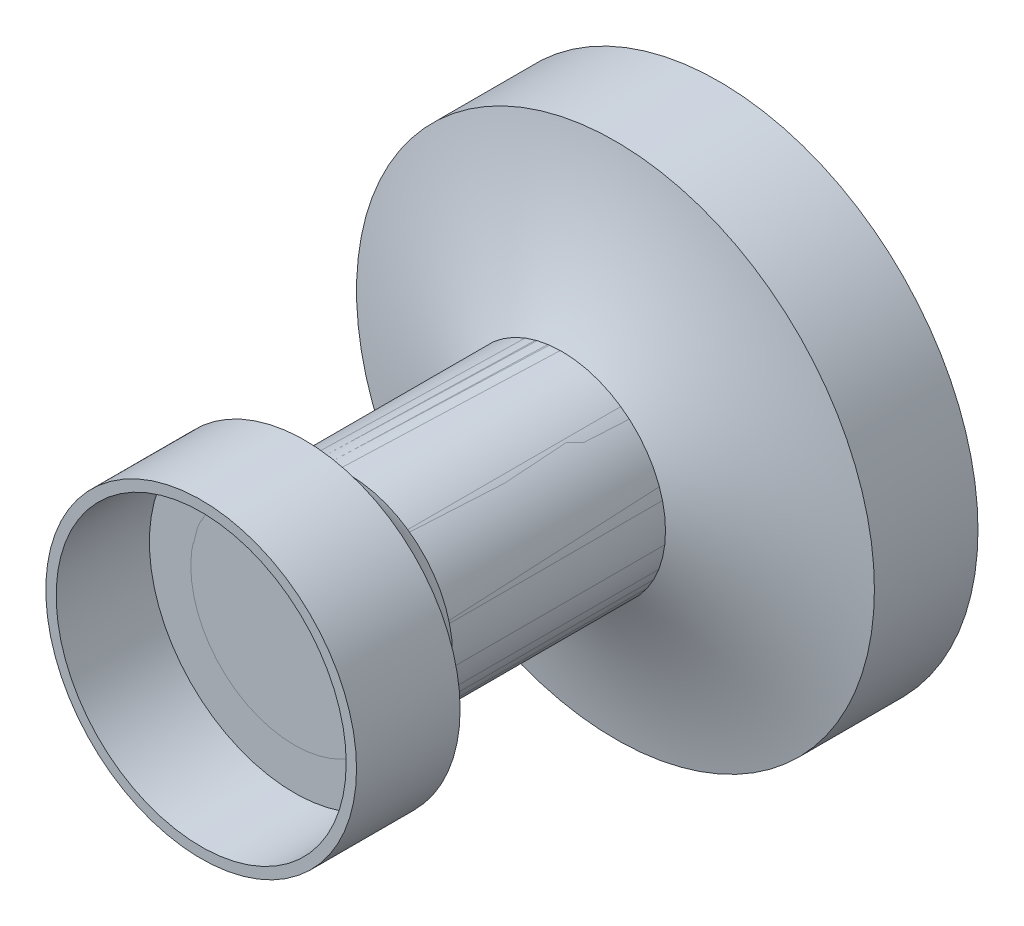
ISO-10303-21;
HEADER;
FILE_DESCRIPTION(('STEP AP214'),'2;1');
FILE_NAME('part.step','',(''),(''),'','','');
FILE_SCHEMA(('AUTOMOTIVE_DESIGN { 1 0 10303 214 1 1 1 1 }'));
ENDSEC;
DATA;
#1=APPLICATION_CONTEXT('core data for automotive mechanical design processes');
#2=APPLICATION_PROTOCOL_DEFINITION('international standard','automotive_design',2000,#1);
#3=PRODUCT_CONTEXT('',#1,'mechanical');
#4=PRODUCT('Part','Part','',(#3));
#5=PRODUCT_RELATED_PRODUCT_CATEGORY('part','',(#4));
#6=PRODUCT_DEFINITION_FORMATION('','',#4);
#7=PRODUCT_DEFINITION_CONTEXT('part definition',#1,'design');
#8=PRODUCT_DEFINITION('design','',#6,#7);
#9=PRODUCT_DEFINITION_SHAPE('','',#8);
#10=(LENGTH_UNIT() NAMED_UNIT(*) SI_UNIT(.MILLI.,.METRE.));
#11=(NAMED_UNIT(*) PLANE_ANGLE_UNIT() SI_UNIT($,.RADIAN.));
#12=(NAMED_UNIT(*) SI_UNIT($,.STERADIAN.) SOLID_ANGLE_UNIT());
#13=UNCERTAINTY_MEASURE_WITH_UNIT(LENGTH_MEASURE(1.E-05),#10,'distance_accuracy_value','');
#14=(GEOMETRIC_REPRESENTATION_CONTEXT(3) GLOBAL_UNCERTAINTY_ASSIGNED_CONTEXT((#13)) GLOBAL_UNIT_ASSIGNED_CONTEXT((#10,
#11,#12)) REPRESENTATION_CONTEXT('',''));
#15=CARTESIAN_POINT('',(0.,0.,0.));
#16=DIRECTION('',(0.,0.,1.));
#17=DIRECTION('',(1.,0.,0.));
#18=AXIS2_PLACEMENT_3D('',#15,#16,#17);
#19=CARTESIAN_POINT('',(0.,0.,3.25292939220291));
#20=DIRECTION('',(0.,0.,1.));
#21=DIRECTION('',(1.,0.,0.));
#22=AXIS2_PLACEMENT_3D('',#19,#20,#21);
#23=TOROIDAL_SURFACE('',#22,1.70771947062035,0.776955906177604);
#24=CARTESIAN_POINT('',(0.,0.,3.57354385078068));
#25=DIRECTION('',(0.,0.,1.));
#26=DIRECTION('',(1.,0.,0.));
#27=AXIS2_PLACEMENT_3D('',#24,#25,#26);
#28=CIRCLE('',#27,1.);
#29=CARTESIAN_POINT('',(1.,0.,3.57354385078068));
#30=VERTEX_POINT('',#29);
#31=EDGE_CURVE('E11',#30,#30,#28,.T.);
#32=ORIENTED_EDGE('',*,*,#31,.T.);
#33=EDGE_LOOP('',(#32));
#34=FACE_BOUND('',#33,.T.);
#35=CARTESIAN_POINT('',(0.,0.,3.99640915675548));
#36=DIRECTION('',(0.,0.,1.));
#37=DIRECTION('',(1.,0.,0.));
#38=AXIS2_PLACEMENT_3D('',#35,#36,#37);
#39=CIRCLE('',#38,1.48211291077528);
#40=CARTESIAN_POINT('',(1.48211291077528,0.,3.99640915675548));
#41=VERTEX_POINT('',#40);
#42=EDGE_CURVE('E51',#41,#41,#39,.T.);
#43=ORIENTED_EDGE('',*,*,#42,.F.);
#44=EDGE_LOOP('',(#43));
#45=FACE_BOUND('',#44,.T.);
#46=ADVANCED_FACE('F41',(#34,#45),#23,.F.);
#47=CARTESIAN_POINT('',(0.,0.,7.04084682706707));
#48=DIRECTION('',(0.,0.,1.));
#49=DIRECTION('',(1.,0.,0.));
#50=AXIS2_PLACEMENT_3D('',#47,#48,#49);
#51=CYLINDRICAL_SURFACE('',#50,1.);
#52=CARTESIAN_POINT('',(0.,0.,3.99640915675548));
#53=DIRECTION('',(0.,0.,1.));
#54=DIRECTION('',(1.,0.,0.));
#55=AXIS2_PLACEMENT_3D('',#52,#53,#54);
#56=CIRCLE('',#55,1.);
#57=CARTESIAN_POINT('',(1.,0.,3.99640915675548));
#58=VERTEX_POINT('',#57);
#59=EDGE_CURVE('E47',#58,#58,#56,.T.);
#60=ORIENTED_EDGE('',*,*,#59,.T.);
#61=EDGE_LOOP('',(#60));
#62=FACE_BOUND('',#61,.T.);
#63=ORIENTED_EDGE('',*,*,#31,.F.);
#64=EDGE_LOOP('',(#63));
#65=FACE_BOUND('',#64,.T.);
#66=ADVANCED_FACE('F62',(#62,#65),#51,.F.);
#67=CARTESIAN_POINT('',(0.,-1.,3.99640915675548));
#68=DIRECTION('',(0.,0.,1.));
#69=DIRECTION('',(1.,0.,0.));
#70=AXIS2_PLACEMENT_3D('',#67,#68,#69);
#71=PLANE('',#70);
#72=ORIENTED_EDGE('',*,*,#42,.T.);
#73=EDGE_LOOP('',(#72));
#74=FACE_BOUND('',#73,.T.);
#75=ORIENTED_EDGE('',*,*,#59,.F.);
#76=EDGE_LOOP('',(#75));
#77=FACE_BOUND('',#76,.T.);
#78=ADVANCED_FACE('F58',(#74,#77),#71,.T.);
#79=CLOSED_SHELL('',(#46,#66,#78));
#80=MANIFOLD_SOLID_BREP('B2',#79);
#81=CARTESIAN_POINT('',(0.,0.,1.));
#82=DIRECTION('',(0.,0.,-1.));
#83=DIRECTION('',(-1.,0.,0.));
#84=AXIS2_PLACEMENT_3D('',#81,#82,#83);
#85=CYLINDRICAL_SURFACE('',#84,1.);
#86=CARTESIAN_POINT('',(0.,0.,0.));
#87=DIRECTION('',(0.,0.,1.));
#88=DIRECTION('',(1.,0.,0.));
#89=AXIS2_PLACEMENT_3D('',#86,#87,#88);
#90=CIRCLE('',#89,1.);
#91=CARTESIAN_POINT('',(1.,0.,0.));
#92=VERTEX_POINT('',#91);
#93=EDGE_CURVE('E99',#92,#92,#90,.T.);
#94=ORIENTED_EDGE('',*,*,#93,.F.);
#95=EDGE_LOOP('',(#94));
#96=FACE_BOUND('',#95,.T.);
#97=CARTESIAN_POINT('',(0.,0.,1.));
#98=DIRECTION('',(0.,0.,1.));
#99=DIRECTION('',(1.,0.,0.));
#100=AXIS2_PLACEMENT_3D('',#97,#98,#99);
#101=CIRCLE('',#100,1.);
#102=CARTESIAN_POINT('',(1.,0.,1.));
#103=VERTEX_POINT('',#102);
#104=EDGE_CURVE('E107',#103,#103,#101,.T.);
#105=ORIENTED_EDGE('',*,*,#104,.T.);
#106=EDGE_LOOP('',(#105));
#107=FACE_BOUND('',#106,.T.);
#108=ADVANCED_FACE('F88',(#96,#107),#85,.F.);
#109=CARTESIAN_POINT('',(0.,0.,0.));
#110=DIRECTION('',(0.,0.,1.));
#111=DIRECTION('',(1.,0.,0.));
#112=AXIS2_PLACEMENT_3D('',#109,#110,#111);
#113=PLANE('',#112);
#114=CARTESIAN_POINT('',(0.,0.,0.));
#115=DIRECTION('',(0.,0.,1.));
#116=DIRECTION('',(1.,0.,0.));
#117=AXIS2_PLACEMENT_3D('',#114,#115,#116);
#118=CIRCLE('',#117,2.5);
#119=CARTESIAN_POINT('',(2.5,0.,0.));
#120=VERTEX_POINT('',#119);
#121=EDGE_CURVE('E92',#120,#120,#118,.T.);
#122=ORIENTED_EDGE('',*,*,#121,.F.);
#123=EDGE_LOOP('',(#122));
#124=FACE_BOUND('',#123,.T.);
#125=ORIENTED_EDGE('',*,*,#93,.T.);
#126=EDGE_LOOP('',(#125));
#127=FACE_BOUND('',#126,.T.);
#128=ADVANCED_FACE('F190',(#124,#127),#113,.F.);
#129=CARTESIAN_POINT('',(0.,0.,1.));
#130=DIRECTION('',(0.,0.,-1.));
#131=DIRECTION('',(-1.,0.,0.));
#132=AXIS2_PLACEMENT_3D('',#129,#130,#131);
#133=CYLINDRICAL_SURFACE('',#132,2.5);
#134=CARTESIAN_POINT('',(0.,0.,1.));
#135=DIRECTION('',(0.,0.,1.));
#136=DIRECTION('',(1.,0.,0.));
#137=AXIS2_PLACEMENT_3D('',#134,#135,#136);
#138=CIRCLE('',#137,2.5);
#139=CARTESIAN_POINT('',(2.5,0.,1.));
#140=VERTEX_POINT('',#139);
#141=EDGE_CURVE('E40',#140,#140,#138,.T.);
#142=ORIENTED_EDGE('',*,*,#141,.F.);
#143=EDGE_LOOP('',(#142));
#144=FACE_BOUND('',#143,.T.);
#145=ORIENTED_EDGE('',*,*,#121,.T.);
#146=EDGE_LOOP('',(#145));
#147=FACE_BOUND('',#146,.T.);
#148=ADVANCED_FACE('F90',(#144,#147),#133,.T.);
#149=CARTESIAN_POINT('',(0.,2.5,1.));
#150=CARTESIAN_POINT('',(0.,1.72965977264994,1.13281984495295));
#151=CARTESIAN_POINT('',(0.,1.,1.51700099904417));
#152=CARTESIAN_POINT('',(0.,0.973294429039858,1.53106204154193));
#153=CARTESIAN_POINT('',(0.,0.946588858079716,1.54512308403968));
#154=B_SPLINE_CURVE_WITH_KNOTS('',2,(#149,#150,#151,#152,#153),.UNSPECIFIED.,.F.,.F.,(3,2,3),
(0.,1.,1.03660003190686),.UNSPECIFIED.);
#155=CARTESIAN_POINT('',(0.,0.,7.04084682706707));
#156=DIRECTION('',(0.,0.,1.));
#157=AXIS1_PLACEMENT('',#155,#156);
#158=SURFACE_OF_REVOLUTION('',#154,#157);
#159=CARTESIAN_POINT('',(0.,0.,1.51700099904417));
#160=DIRECTION('',(0.,0.,1.));
#161=DIRECTION('',(1.,0.,0.));
#162=AXIS2_PLACEMENT_3D('',#159,#160,#161);
#163=CIRCLE('',#162,1.);
#164=CARTESIAN_POINT('',(1.,0.,1.51700099904417));
#165=VERTEX_POINT('',#164);
#166=EDGE_CURVE('E103',#165,#165,#163,.T.);
#167=ORIENTED_EDGE('',*,*,#166,.F.);
#168=EDGE_LOOP('',(#167));
#169=FACE_BOUND('',#168,.T.);
#170=ORIENTED_EDGE('',*,*,#141,.T.);
#171=EDGE_LOOP('',(#170));
#172=FACE_BOUND('',#171,.T.);
#173=ADVANCED_FACE('F135',(#169,#172),#158,.T.);
#174=CARTESIAN_POINT('',(0.,0.,4.));
#175=DIRECTION('',(0.,0.,-1.));
#176=DIRECTION('',(-1.,0.,0.));
#177=AXIS2_PLACEMENT_3D('',#174,#175,#176);
#178=CYLINDRICAL_SURFACE('',#177,1.);
#179=CARTESIAN_POINT('',(0.,0.,4.));
#180=DIRECTION('',(0.,0.,1.));
#181=DIRECTION('',(1.,0.,0.));
#182=AXIS2_PLACEMENT_3D('',#179,#180,#181);
#183=CIRCLE('',#182,1.);
#184=CARTESIAN_POINT('',(1.,0.,4.));
#185=VERTEX_POINT('',#184);
#186=EDGE_CURVE('E106',#185,#185,#183,.T.);
#187=ORIENTED_EDGE('',*,*,#186,.F.);
#188=EDGE_LOOP('',(#187));
#189=FACE_BOUND('',#188,.T.);
#190=ORIENTED_EDGE('',*,*,#166,.T.);
#191=EDGE_LOOP('',(#190));
#192=FACE_BOUND('',#191,.T.);
#193=ADVANCED_FACE('F140',(#189,#192),#178,.T.);
#194=CARTESIAN_POINT('',(0.,0.,1.));
#195=DIRECTION('',(0.,0.,1.));
#196=DIRECTION('',(1.,0.,0.));
#197=AXIS2_PLACEMENT_3D('',#194,#195,#196);
#198=PLANE('',#197);
#199=CARTESIAN_POINT('',(0.,0.,1.));
#200=DIRECTION('',(0.,0.,1.));
#201=DIRECTION('',(1.,0.,0.));
#202=AXIS2_PLACEMENT_3D('',#199,#200,#201);
#203=CIRCLE('',#202,0.9);
#204=CARTESIAN_POINT('',(0.9,0.,1.));
#205=VERTEX_POINT('',#204);
#206=EDGE_CURVE('E110',#205,#205,#203,.T.);
#207=ORIENTED_EDGE('',*,*,#206,.T.);
#208=EDGE_LOOP('',(#207));
#209=FACE_BOUND('',#208,.T.);
#210=ORIENTED_EDGE('',*,*,#104,.F.);
#211=EDGE_LOOP('',(#210));
#212=FACE_BOUND('',#211,.T.);
#213=ADVANCED_FACE('F181',(#209,#212),#198,.F.);
#214=CARTESIAN_POINT('',(0.,0.,4.));
#215=DIRECTION('',(0.,0.,-1.));
#216=DIRECTION('',(-1.,0.,0.));
#217=AXIS2_PLACEMENT_3D('',#214,#215,#216);
#218=CYLINDRICAL_SURFACE('',#217,0.9);
#219=CARTESIAN_POINT('',(0.,0.,4.));
#220=DIRECTION('',(0.,0.,1.));
#221=DIRECTION('',(1.,0.,0.));
#222=AXIS2_PLACEMENT_3D('',#219,#220,#221);
#223=CIRCLE('',#222,0.9);
#224=CARTESIAN_POINT('',(0.9,0.,4.));
#225=VERTEX_POINT('',#224);
#226=EDGE_CURVE('E115',#225,#225,#223,.T.);
#227=ORIENTED_EDGE('',*,*,#226,.T.);
#228=EDGE_LOOP('',(#227));
#229=FACE_BOUND('',#228,.T.);
#230=ORIENTED_EDGE('',*,*,#206,.F.);
#231=EDGE_LOOP('',(#230));
#232=FACE_BOUND('',#231,.T.);
#233=ADVANCED_FACE('F173',(#229,#232),#218,.F.);
#234=CARTESIAN_POINT('',(0.,0.,4.));
#235=DIRECTION('',(0.,0.,1.));
#236=DIRECTION('',(1.,0.,0.));
#237=AXIS2_PLACEMENT_3D('',#234,#235,#236);
#238=PLANE('',#237);
#239=ORIENTED_EDGE('',*,*,#186,.T.);
#240=EDGE_LOOP('',(#239));
#241=FACE_BOUND('',#240,.T.);
#242=CARTESIAN_POINT('',(0.,0.,4.));
#243=DIRECTION('',(0.,0.,1.));
#244=DIRECTION('',(1.,0.,0.));
#245=AXIS2_PLACEMENT_3D('',#242,#243,#244);
#246=CIRCLE('',#245,1.5);
#247=CARTESIAN_POINT('',(1.5,0.,4.));
#248=VERTEX_POINT('',#247);
#249=EDGE_CURVE('E119',#248,#248,#246,.T.);
#250=ORIENTED_EDGE('',*,*,#249,.F.);
#251=EDGE_LOOP('',(#250));
#252=FACE_BOUND('',#251,.T.);
#253=ADVANCED_FACE('F169',(#241,#252),#238,.F.);
#254=CARTESIAN_POINT('',(0.,0.,5.));
#255=DIRECTION('',(0.,0.,1.));
#256=DIRECTION('',(1.,0.,0.));
#257=AXIS2_PLACEMENT_3D('',#254,#255,#256);
#258=PLANE('',#257);
#259=CARTESIAN_POINT('',(0.,0.,5.));
#260=DIRECTION('',(0.,0.,1.));
#261=DIRECTION('',(1.,0.,0.));
#262=AXIS2_PLACEMENT_3D('',#259,#260,#261);
#263=CIRCLE('',#262,1.4);
#264=CARTESIAN_POINT('',(1.4,0.,5.));
#265=VERTEX_POINT('',#264);
#266=EDGE_CURVE('E129',#265,#265,#263,.T.);
#267=ORIENTED_EDGE('',*,*,#266,.F.);
#268=EDGE_LOOP('',(#267));
#269=FACE_BOUND('',#268,.T.);
#270=CARTESIAN_POINT('',(0.,0.,5.));
#271=DIRECTION('',(0.,0.,1.));
#272=DIRECTION('',(1.,0.,0.));
#273=AXIS2_PLACEMENT_3D('',#270,#271,#272);
#274=CIRCLE('',#273,1.5);
#275=CARTESIAN_POINT('',(1.5,0.,5.));
#276=VERTEX_POINT('',#275);
#277=EDGE_CURVE('E118',#276,#276,#274,.T.);
#278=ORIENTED_EDGE('',*,*,#277,.T.);
#279=EDGE_LOOP('',(#278));
#280=FACE_BOUND('',#279,.T.);
#281=ADVANCED_FACE('F165',(#269,#280),#258,.T.);
#282=CARTESIAN_POINT('',(0.,0.,5.));
#283=DIRECTION('',(0.,0.,-1.));
#284=DIRECTION('',(-1.,0.,0.));
#285=AXIS2_PLACEMENT_3D('',#282,#283,#284);
#286=CYLINDRICAL_SURFACE('',#285,1.5);
#287=ORIENTED_EDGE('',*,*,#277,.F.);
#288=EDGE_LOOP('',(#287));
#289=FACE_BOUND('',#288,.T.);
#290=ORIENTED_EDGE('',*,*,#249,.T.);
#291=EDGE_LOOP('',(#290));
#292=FACE_BOUND('',#291,.T.);
#293=ADVANCED_FACE('F168',(#289,#292),#286,.T.);
#294=ORIENTED_EDGE('',*,*,#226,.F.);
#295=EDGE_LOOP('',(#294));
#296=FACE_BOUND('',#295,.T.);
#297=ADVANCED_FACE('F175',(#296),#238,.F.);
#298=CARTESIAN_POINT('',(0.,0.,1.));
#299=DIRECTION('',(0.,0.,-1.));
#300=DIRECTION('',(-1.,0.,0.));
#301=AXIS2_PLACEMENT_3D('',#298,#299,#300);
#302=CYLINDRICAL_SURFACE('',#301,1.1);
#303=CARTESIAN_POINT('',(0.,0.,0.1));
#304=DIRECTION('',(0.,0.,1.));
#305=DIRECTION('',(1.,0.,0.));
#306=AXIS2_PLACEMENT_3D('',#303,#304,#305);
#307=CIRCLE('',#306,1.1);
#308=CARTESIAN_POINT('',(1.1,0.,0.1));
#309=VERTEX_POINT('',#308);
#310=EDGE_CURVE('E375',#309,#309,#307,.T.);
#311=ORIENTED_EDGE('',*,*,#310,.T.);
#312=EDGE_LOOP('',(#311));
#313=FACE_BOUND('',#312,.T.);
#314=CARTESIAN_POINT('',(0.,0.,1.1));
#315=DIRECTION('',(0.,0.,1.));
#316=DIRECTION('',(1.,0.,0.));
#317=AXIS2_PLACEMENT_3D('',#314,#315,#316);
#318=CIRCLE('',#317,1.1);
#319=CARTESIAN_POINT('',(1.1,0.,1.1));
#320=VERTEX_POINT('',#319);
#321=EDGE_CURVE('E362',#320,#320,#318,.T.);
#322=ORIENTED_EDGE('',*,*,#321,.F.);
#323=EDGE_LOOP('',(#322));
#324=FACE_BOUND('',#323,.T.);
#325=ADVANCED_FACE('F243',(#313,#324),#302,.T.);
#326=CARTESIAN_POINT('',(0.,0.,0.1));
#327=DIRECTION('',(0.,0.,1.));
#328=DIRECTION('',(1.,0.,0.));
#329=AXIS2_PLACEMENT_3D('',#326,#327,#328);
#330=PLANE('',#329);
#331=CARTESIAN_POINT('',(0.,0.,0.1));
#332=DIRECTION('',(0.,0.,1.));
#333=DIRECTION('',(1.,0.,0.));
#334=AXIS2_PLACEMENT_3D('',#331,#332,#333);
#335=CIRCLE('',#334,2.4);
#336=CARTESIAN_POINT('',(2.4,0.,0.1));
#337=VERTEX_POINT('',#336);
#338=EDGE_CURVE('E378',#337,#337,#335,.T.);
#339=ORIENTED_EDGE('',*,*,#338,.T.);
#340=EDGE_LOOP('',(#339));
#341=FACE_BOUND('',#340,.T.);
#342=ORIENTED_EDGE('',*,*,#310,.F.);
#343=EDGE_LOOP('',(#342));
#344=FACE_BOUND('',#343,.T.);
#345=ADVANCED_FACE('F250',(#341,#344),#330,.T.);
#346=CARTESIAN_POINT('',(0.,0.,1.));
#347=DIRECTION('',(0.,0.,-1.));
#348=DIRECTION('',(-1.,0.,0.));
#349=AXIS2_PLACEMENT_3D('',#346,#347,#348);
#350=CYLINDRICAL_SURFACE('',#349,2.4);
#351=CARTESIAN_POINT('',(0.,0.,0.916502991753792));
#352=DIRECTION('',(0.,0.,1.));
#353=DIRECTION('',(1.,0.,0.));
#354=AXIS2_PLACEMENT_3D('',#351,#352,#353);
#355=CIRCLE('',#354,2.4);
#356=CARTESIAN_POINT('',(2.4,0.,0.916502991753792));
#357=VERTEX_POINT('',#356);
#358=EDGE_CURVE('E122',#357,#357,#355,.T.);
#359=ORIENTED_EDGE('',*,*,#358,.T.);
#360=EDGE_LOOP('',(#359));
#361=FACE_BOUND('',#360,.T.);
#362=ORIENTED_EDGE('',*,*,#338,.F.);
#363=EDGE_LOOP('',(#362));
#364=FACE_BOUND('',#363,.T.);
#365=ADVANCED_FACE('F258',(#361,#364),#350,.F.);
#366=CARTESIAN_POINT('',(0.,2.5,1.));
#367=CARTESIAN_POINT('',(0.,1.72965977264994,1.13281984495295));
#368=CARTESIAN_POINT('',(0.,0.973294429039858,1.53106204154193));
#369=CARTESIAN_POINT('',(0.,0.946588858079716,1.54512308403968));
#370=B_SPLINE_CURVE_WITH_KNOTS('',2,(#366,#367,#368,#369),.UNSPECIFIED.,.F.,.F.,(3,1,3),(0.,1.,
1.03660003190686),.UNSPECIFIED.);
#371=CARTESIAN_POINT('',(0.,0.,7.04084682706707));
#372=DIRECTION('',(0.,0.,1.));
#373=AXIS1_PLACEMENT('',#371,#372);
#374=SURFACE_OF_REVOLUTION('',#370,#373);
#375=OFFSET_SURFACE('',#374,-0.1,.F.);
#376=CARTESIAN_POINT('',(0.,0.,1.45663874473137));
#377=DIRECTION('',(0.,0.,1.));
#378=DIRECTION('',(1.,0.,0.));
#379=AXIS2_PLACEMENT_3D('',#376,#377,#378);
#380=CIRCLE('',#379,0.9);
#381=CARTESIAN_POINT('',(0.9,0.,1.45663874473137));
#382=VERTEX_POINT('',#381);
#383=EDGE_CURVE('E372',#382,#382,#380,.T.);
#384=ORIENTED_EDGE('',*,*,#383,.T.);
#385=EDGE_LOOP('',(#384));
#386=FACE_BOUND('',#385,.T.);
#387=ORIENTED_EDGE('',*,*,#358,.F.);
#388=EDGE_LOOP('',(#387));
#389=FACE_BOUND('',#388,.T.);
#390=ADVANCED_FACE('F142',(#386,#389),#375,.F.);
#391=CARTESIAN_POINT('',(0.,0.,4.));
#392=DIRECTION('',(0.,0.,-1.));
#393=DIRECTION('',(-1.,0.,0.));
#394=AXIS2_PLACEMENT_3D('',#391,#392,#393);
#395=CYLINDRICAL_SURFACE('',#394,0.9);
#396=CARTESIAN_POINT('',(0.,0.,4.1));
#397=DIRECTION('',(0.,0.,1.));
#398=DIRECTION('',(1.,0.,0.));
#399=AXIS2_PLACEMENT_3D('',#396,#397,#398);
#400=CIRCLE('',#399,0.9);
#401=CARTESIAN_POINT('',(0.9,0.,4.1));
#402=VERTEX_POINT('',#401);
#403=EDGE_CURVE('E369',#402,#402,#400,.T.);
#404=ORIENTED_EDGE('',*,*,#403,.T.);
#405=EDGE_LOOP('',(#404));
#406=FACE_BOUND('',#405,.T.);
#407=ORIENTED_EDGE('',*,*,#383,.F.);
#408=EDGE_LOOP('',(#407));
#409=FACE_BOUND('',#408,.T.);
#410=ADVANCED_FACE('F144',(#406,#409),#395,.F.);
#411=CARTESIAN_POINT('',(0.,0.,1.1));
#412=DIRECTION('',(0.,0.,1.));
#413=DIRECTION('',(1.,0.,0.));
#414=AXIS2_PLACEMENT_3D('',#411,#412,#413);
#415=PLANE('',#414);
#416=CARTESIAN_POINT('',(0.,0.,1.1));
#417=DIRECTION('',(0.,0.,1.));
#418=DIRECTION('',(1.,0.,0.));
#419=AXIS2_PLACEMENT_3D('',#416,#417,#418);
#420=CIRCLE('',#419,1.);
#421=CARTESIAN_POINT('',(1.,0.,1.1));
#422=VERTEX_POINT('',#421);
#423=EDGE_CURVE('E360',#422,#422,#420,.T.);
#424=ORIENTED_EDGE('',*,*,#423,.F.);
#425=EDGE_LOOP('',(#424));
#426=FACE_BOUND('',#425,.T.);
#427=ORIENTED_EDGE('',*,*,#321,.T.);
#428=EDGE_LOOP('',(#427));
#429=FACE_BOUND('',#428,.T.);
#430=ADVANCED_FACE('F147',(#426,#429),#415,.T.);
#431=CARTESIAN_POINT('',(0.,0.,4.));
#432=DIRECTION('',(0.,0.,-1.));
#433=DIRECTION('',(-1.,0.,0.));
#434=AXIS2_PLACEMENT_3D('',#431,#432,#433);
#435=CYLINDRICAL_SURFACE('',#434,1.);
#436=CARTESIAN_POINT('',(0.,0.,4.1));
#437=DIRECTION('',(0.,0.,1.));
#438=DIRECTION('',(1.,0.,0.));
#439=AXIS2_PLACEMENT_3D('',#436,#437,#438);
#440=CIRCLE('',#439,1.);
#441=CARTESIAN_POINT('',(1.,0.,4.1));
#442=VERTEX_POINT('',#441);
#443=EDGE_CURVE('E359',#442,#442,#440,.T.);
#444=ORIENTED_EDGE('',*,*,#443,.F.);
#445=EDGE_LOOP('',(#444));
#446=FACE_BOUND('',#445,.T.);
#447=ORIENTED_EDGE('',*,*,#423,.T.);
#448=EDGE_LOOP('',(#447));
#449=FACE_BOUND('',#448,.T.);
#450=ADVANCED_FACE('F151',(#446,#449),#435,.T.);
#451=CARTESIAN_POINT('',(0.,0.,4.1));
#452=DIRECTION('',(0.,0.,1.));
#453=DIRECTION('',(1.,0.,0.));
#454=AXIS2_PLACEMENT_3D('',#451,#452,#453);
#455=PLANE('',#454);
#456=ORIENTED_EDGE('',*,*,#403,.F.);
#457=EDGE_LOOP('',(#456));
#458=FACE_BOUND('',#457,.T.);
#459=CARTESIAN_POINT('',(0.,0.,4.1));
#460=DIRECTION('',(0.,0.,1.));
#461=DIRECTION('',(1.,0.,0.));
#462=AXIS2_PLACEMENT_3D('',#459,#460,#461);
#463=CIRCLE('',#462,1.4);
#464=CARTESIAN_POINT('',(1.4,0.,4.1));
#465=VERTEX_POINT('',#464);
#466=EDGE_CURVE('E365',#465,#465,#463,.T.);
#467=ORIENTED_EDGE('',*,*,#466,.T.);
#468=EDGE_LOOP('',(#467));
#469=FACE_BOUND('',#468,.T.);
#470=ADVANCED_FACE('F155',(#458,#469),#455,.T.);
#471=CARTESIAN_POINT('',(0.,0.,5.));
#472=DIRECTION('',(0.,0.,-1.));
#473=DIRECTION('',(-1.,0.,0.));
#474=AXIS2_PLACEMENT_3D('',#471,#472,#473);
#475=CYLINDRICAL_SURFACE('',#474,1.4);
#476=ORIENTED_EDGE('',*,*,#266,.T.);
#477=EDGE_LOOP('',(#476));
#478=FACE_BOUND('',#477,.T.);
#479=ORIENTED_EDGE('',*,*,#466,.F.);
#480=EDGE_LOOP('',(#479));
#481=FACE_BOUND('',#480,.T.);
#482=ADVANCED_FACE('F159',(#478,#481),#475,.F.);
#483=ORIENTED_EDGE('',*,*,#443,.T.);
#484=EDGE_LOOP('',(#483));
#485=FACE_BOUND('',#484,.T.);
#486=ADVANCED_FACE('F161',(#485),#455,.T.);
#487=CLOSED_SHELL('',(#108,#128,#148,#173,#193,#213,#233,#253,#281,#293,#297,#325,#345,#365,
#390,#410,#430,#450,#470,#482,#486));
#488=MANIFOLD_SOLID_BREP('B6',#487);
#489=ADVANCED_BREP_SHAPE_REPRESENTATION('',(#18,#80,#488),#14);
#490=SHAPE_DEFINITION_REPRESENTATION(#9,#489);
ENDSEC;
END-ISO-10303-21;
